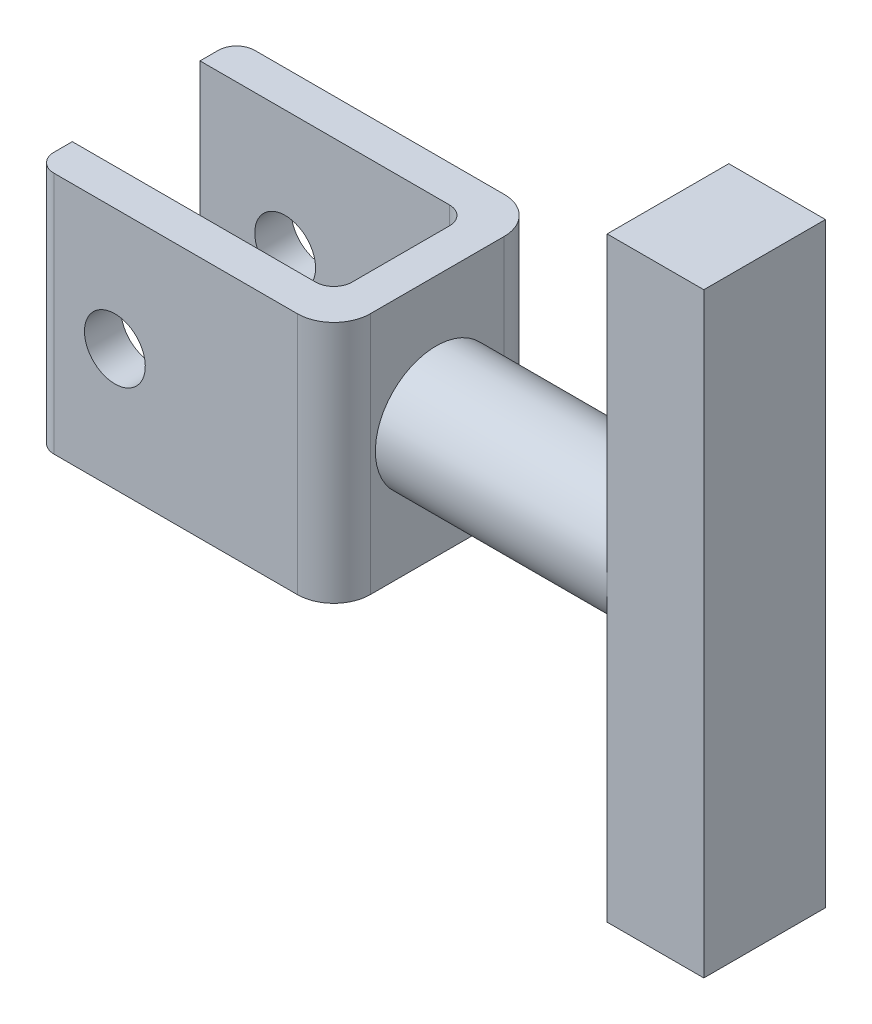
ISO-10303-21;
HEADER;
FILE_DESCRIPTION(('STEP AP214'),'2;1');
FILE_NAME('part.step','',(''),(''),'','','');
FILE_SCHEMA(('AUTOMOTIVE_DESIGN { 1 0 10303 214 1 1 1 1 }'));
ENDSEC;
DATA;
#1=APPLICATION_CONTEXT('core data for automotive mechanical design processes');
#2=APPLICATION_PROTOCOL_DEFINITION('international standard','automotive_design',2000,#1);
#3=PRODUCT_CONTEXT('',#1,'mechanical');
#4=PRODUCT('Part','Part','',(#3));
#5=PRODUCT_RELATED_PRODUCT_CATEGORY('part','',(#4));
#6=PRODUCT_DEFINITION_FORMATION('','',#4);
#7=PRODUCT_DEFINITION_CONTEXT('part definition',#1,'design');
#8=PRODUCT_DEFINITION('design','',#6,#7);
#9=PRODUCT_DEFINITION_SHAPE('','',#8);
#10=(LENGTH_UNIT() NAMED_UNIT(*) SI_UNIT(.MILLI.,.METRE.));
#11=(NAMED_UNIT(*) PLANE_ANGLE_UNIT() SI_UNIT($,.RADIAN.));
#12=(NAMED_UNIT(*) SI_UNIT($,.STERADIAN.) SOLID_ANGLE_UNIT());
#13=UNCERTAINTY_MEASURE_WITH_UNIT(LENGTH_MEASURE(1.E-05),#10,'distance_accuracy_value','');
#14=(GEOMETRIC_REPRESENTATION_CONTEXT(3) GLOBAL_UNCERTAINTY_ASSIGNED_CONTEXT((#13)) GLOBAL_UNIT_ASSIGNED_CONTEXT((#10,
#11,#12)) REPRESENTATION_CONTEXT('',''));
#15=CARTESIAN_POINT('',(0.,0.,0.));
#16=DIRECTION('',(0.,0.,1.));
#17=DIRECTION('',(1.,0.,0.));
#18=AXIS2_PLACEMENT_3D('',#15,#16,#17);
#19=CARTESIAN_POINT('',(39.3737373737374,0.,0.));
#20=DIRECTION('',(-1.,0.,0.));
#21=DIRECTION('',(0.,-1.,0.));
#22=AXIS2_PLACEMENT_3D('',#19,#20,#21);
#23=CYLINDRICAL_SURFACE('',#22,5.);
#24=CARTESIAN_POINT('',(12.3737373737374,0.,0.));
#25=DIRECTION('',(-1.,0.,0.));
#26=DIRECTION('',(0.,-1.,0.));
#27=AXIS2_PLACEMENT_3D('',#24,#25,#26);
#28=CIRCLE('',#27,5.);
#29=CARTESIAN_POINT('',(12.3737373737374,-5.,0.));
#30=VERTEX_POINT('',#29);
#31=EDGE_CURVE('E11',#30,#30,#28,.F.);
#32=ORIENTED_EDGE('',*,*,#31,.T.);
#33=EDGE_LOOP('',(#32));
#34=FACE_BOUND('',#33,.T.);
#35=CARTESIAN_POINT('',(31.4264677837374,0.,0.));
#36=DIRECTION('',(1.,0.,0.));
#37=DIRECTION('',(0.,1.,0.));
#38=AXIS2_PLACEMENT_3D('',#35,#36,#37);
#39=CIRCLE('',#38,5.);
#40=CARTESIAN_POINT('',(31.4264677837374,0.,5.));
#41=VERTEX_POINT('',#40);
#42=CARTESIAN_POINT('',(31.4264677837374,0.,-5.));
#43=VERTEX_POINT('',#42);
#44=EDGE_CURVE('E25',#41,#43,#39,.T.);
#45=ORIENTED_EDGE('',*,*,#44,.F.);
#46=CARTESIAN_POINT('',(31.4264677837374,0.,0.));
#47=DIRECTION('',(1.,0.,0.));
#48=DIRECTION('',(0.,1.,0.));
#49=AXIS2_PLACEMENT_3D('',#46,#47,#48);
#50=CIRCLE('',#49,5.);
#51=EDGE_CURVE('E40',#43,#41,#50,.T.);
#52=ORIENTED_EDGE('',*,*,#51,.F.);
#53=EDGE_LOOP('',(#45,#52));
#54=FACE_BOUND('',#53,.T.);
#55=ADVANCED_FACE('F17',(#34,#54),#23,.T.);
#56=CARTESIAN_POINT('',(12.3737373737374,-10.,-5.58585858585859));
#57=DIRECTION('',(-1.,0.,0.));
#58=DIRECTION('',(0.,-1.,0.));
#59=AXIS2_PLACEMENT_3D('',#56,#57,#58);
#60=PLANE('',#59);
#61=DIRECTION('',(0.,0.,1.));
#62=VECTOR('',#61,1.);
#63=CARTESIAN_POINT('',(12.3737373737374,10.,-5.58585858585859));
#64=LINE('',#63,#62);
#65=CARTESIAN_POINT('',(12.3737373737374,10.,-5.58585858585859));
#66=VERTEX_POINT('',#65);
#67=CARTESIAN_POINT('',(12.3737373737374,10.,5.41414141414142));
#68=VERTEX_POINT('',#67);
#69=EDGE_CURVE('E412',#66,#68,#64,.T.);
#70=ORIENTED_EDGE('',*,*,#69,.T.);
#71=DIRECTION('',(0.,1.,0.));
#72=VECTOR('',#71,1.);
#73=CARTESIAN_POINT('',(12.3737373737374,-10.,5.41414141414142));
#74=LINE('',#73,#72);
#75=CARTESIAN_POINT('',(12.3737373737374,-10.,5.41414141414142));
#76=VERTEX_POINT('',#75);
#77=EDGE_CURVE('E408',#76,#68,#74,.T.);
#78=ORIENTED_EDGE('',*,*,#77,.F.);
#79=DIRECTION('',(0.,0.,1.));
#80=VECTOR('',#79,1.);
#81=CARTESIAN_POINT('',(12.3737373737374,-10.,-5.58585858585859));
#82=LINE('',#81,#80);
#83=CARTESIAN_POINT('',(12.3737373737374,-10.,-5.58585858585859));
#84=VERTEX_POINT('',#83);
#85=EDGE_CURVE('E404',#84,#76,#82,.T.);
#86=ORIENTED_EDGE('',*,*,#85,.F.);
#87=DIRECTION('',(0.,1.,0.));
#88=VECTOR('',#87,1.);
#89=CARTESIAN_POINT('',(12.3737373737374,-10.,-5.58585858585859));
#90=LINE('',#89,#88);
#91=EDGE_CURVE('E401',#84,#66,#90,.T.);
#92=ORIENTED_EDGE('',*,*,#91,.T.);
#93=EDGE_LOOP('',(#70,#78,#86,#92));
#94=FACE_BOUND('',#93,.T.);
#95=ORIENTED_EDGE('',*,*,#31,.F.);
#96=EDGE_LOOP('',(#95));
#97=FACE_BOUND('',#96,.T.);
#98=ADVANCED_FACE('F439',(#94,#97),#60,.F.);
#99=CARTESIAN_POINT('',(-12.1262626262626,-10.,6.91414141414142));
#100=DIRECTION('',(1.,0.,0.));
#101=DIRECTION('',(0.,0.,1.));
#102=AXIS2_PLACEMENT_3D('',#99,#100,#101);
#103=PLANE('',#102);
#104=DIRECTION('',(0.,0.,-1.));
#105=VECTOR('',#104,1.);
#106=CARTESIAN_POINT('',(-12.1262626262626,10.,6.91414141414142));
#107=LINE('',#106,#105);
#108=CARTESIAN_POINT('',(-12.1262626262626,10.,6.91414141414142));
#109=VERTEX_POINT('',#108);
#110=CARTESIAN_POINT('',(-12.1262626262626,10.,5.41414141414142));
#111=VERTEX_POINT('',#110);
#112=EDGE_CURVE('E398',#109,#111,#107,.T.);
#113=ORIENTED_EDGE('',*,*,#112,.T.);
#114=DIRECTION('',(0.,1.,0.));
#115=VECTOR('',#114,1.);
#116=CARTESIAN_POINT('',(-12.1262626262626,-10.,5.41414141414142));
#117=LINE('',#116,#115);
#118=CARTESIAN_POINT('',(-12.1262626262626,-10.,5.41414141414142));
#119=VERTEX_POINT('',#118);
#120=EDGE_CURVE('E394',#119,#111,#117,.T.);
#121=ORIENTED_EDGE('',*,*,#120,.F.);
#122=DIRECTION('',(0.,0.,-1.));
#123=VECTOR('',#122,1.);
#124=CARTESIAN_POINT('',(-12.1262626262626,-10.,6.91414141414142));
#125=LINE('',#124,#123);
#126=CARTESIAN_POINT('',(-12.1262626262626,-10.,6.91414141414142));
#127=VERTEX_POINT('',#126);
#128=EDGE_CURVE('E390',#127,#119,#125,.T.);
#129=ORIENTED_EDGE('',*,*,#128,.F.);
#130=DIRECTION('',(0.,1.,0.));
#131=VECTOR('',#130,1.);
#132=CARTESIAN_POINT('',(-12.1262626262626,-10.,6.91414141414142));
#133=LINE('',#132,#131);
#134=EDGE_CURVE('E387',#127,#109,#133,.T.);
#135=ORIENTED_EDGE('',*,*,#134,.T.);
#136=EDGE_LOOP('',(#113,#121,#129,#135));
#137=FACE_BOUND('',#136,.T.);
#138=ADVANCED_FACE('F449',(#137),#103,.F.);
#139=CARTESIAN_POINT('',(-12.1262626262626,-10.,5.41414141414142));
#140=DIRECTION('',(0.,0.,1.));
#141=DIRECTION('',(0.,-1.,0.));
#142=AXIS2_PLACEMENT_3D('',#139,#140,#141);
#143=PLANE('',#142);
#144=CARTESIAN_POINT('',(-5.62626262626262,0.,5.41414141414141));
#145=DIRECTION('',(0.,0.,1.));
#146=DIRECTION('',(0.,-1.,0.));
#147=AXIS2_PLACEMENT_3D('',#144,#145,#146);
#148=CIRCLE('',#147,2.5);
#149=CARTESIAN_POINT('',(-5.62626262626262,-2.5,5.41414141414141));
#150=VERTEX_POINT('',#149);
#151=EDGE_CURVE('E383',#150,#150,#148,.T.);
#152=ORIENTED_EDGE('',*,*,#151,.T.);
#153=EDGE_LOOP('',(#152));
#154=FACE_BOUND('',#153,.T.);
#155=DIRECTION('',(1.,0.,0.));
#156=VECTOR('',#155,1.);
#157=CARTESIAN_POINT('',(-12.1262626262626,10.,5.41414141414142));
#158=LINE('',#157,#156);
#159=CARTESIAN_POINT('',(7.87373737373738,10.,5.41414141414142));
#160=VERTEX_POINT('',#159);
#161=EDGE_CURVE('E380',#111,#160,#158,.T.);
#162=ORIENTED_EDGE('',*,*,#161,.T.);
#163=DIRECTION('',(0.,1.,0.));
#164=VECTOR('',#163,1.);
#165=CARTESIAN_POINT('',(7.87373737373738,-10.,5.41414141414142));
#166=LINE('',#165,#164);
#167=CARTESIAN_POINT('',(7.87373737373738,-10.,5.41414141414142));
#168=VERTEX_POINT('',#167);
#169=EDGE_CURVE('E376',#168,#160,#166,.T.);
#170=ORIENTED_EDGE('',*,*,#169,.F.);
#171=DIRECTION('',(1.,0.,0.));
#172=VECTOR('',#171,1.);
#173=CARTESIAN_POINT('',(-12.1262626262626,-10.,5.41414141414142));
#174=LINE('',#173,#172);
#175=EDGE_CURVE('E372',#119,#168,#174,.T.);
#176=ORIENTED_EDGE('',*,*,#175,.F.);
#177=ORIENTED_EDGE('',*,*,#120,.T.);
#178=EDGE_LOOP('',(#162,#170,#176,#177));
#179=FACE_BOUND('',#178,.T.);
#180=ADVANCED_FACE('F458',(#154,#179),#143,.F.);
#181=CARTESIAN_POINT('',(7.87373737373737,-10.,3.91414141414142));
#182=DIRECTION('',(0.,1.,0.));
#183=DIRECTION('',(-1.,0.,0.));
#184=AXIS2_PLACEMENT_3D('',#181,#182,#183);
#185=CYLINDRICAL_SURFACE('',#184,1.5);
#186=CARTESIAN_POINT('',(7.87373737373737,10.,3.91414141414142));
#187=DIRECTION('',(0.,1.,0.));
#188=DIRECTION('',(-1.,0.,0.));
#189=AXIS2_PLACEMENT_3D('',#186,#187,#188);
#190=CIRCLE('',#189,1.5);
#191=CARTESIAN_POINT('',(9.37373737373737,10.,3.91414141414142));
#192=VERTEX_POINT('',#191);
#193=EDGE_CURVE('E369',#160,#192,#190,.T.);
#194=ORIENTED_EDGE('',*,*,#193,.T.);
#195=DIRECTION('',(0.,1.,0.));
#196=VECTOR('',#195,1.);
#197=CARTESIAN_POINT('',(9.37373737373737,-10.,3.91414141414142));
#198=LINE('',#197,#196);
#199=CARTESIAN_POINT('',(9.37373737373737,-10.,3.91414141414142));
#200=VERTEX_POINT('',#199);
#201=EDGE_CURVE('E365',#200,#192,#198,.T.);
#202=ORIENTED_EDGE('',*,*,#201,.F.);
#203=CARTESIAN_POINT('',(7.87373737373737,-10.,3.91414141414142));
#204=DIRECTION('',(0.,1.,0.));
#205=DIRECTION('',(-1.,0.,0.));
#206=AXIS2_PLACEMENT_3D('',#203,#204,#205);
#207=CIRCLE('',#206,1.5);
#208=EDGE_CURVE('E361',#168,#200,#207,.T.);
#209=ORIENTED_EDGE('',*,*,#208,.F.);
#210=ORIENTED_EDGE('',*,*,#169,.T.);
#211=EDGE_LOOP('',(#194,#202,#209,#210));
#212=FACE_BOUND('',#211,.T.);
#213=ADVANCED_FACE('F468',(#212),#185,.F.);
#214=CARTESIAN_POINT('',(9.37373737373737,-10.,-4.08585858585859));
#215=DIRECTION('',(1.,0.,0.));
#216=DIRECTION('',(0.,1.,0.));
#217=AXIS2_PLACEMENT_3D('',#214,#215,#216);
#218=PLANE('',#217);
#219=DIRECTION('',(0.,0.,-1.));
#220=VECTOR('',#219,1.);
#221=CARTESIAN_POINT('',(9.37373737373737,10.,-4.08585858585859));
#222=LINE('',#221,#220);
#223=CARTESIAN_POINT('',(9.37373737373737,10.,-4.08585858585859));
#224=VERTEX_POINT('',#223);
#225=EDGE_CURVE('E358',#192,#224,#222,.T.);
#226=ORIENTED_EDGE('',*,*,#225,.T.);
#227=DIRECTION('',(0.,1.,0.));
#228=VECTOR('',#227,1.);
#229=CARTESIAN_POINT('',(9.37373737373737,-10.,-4.08585858585859));
#230=LINE('',#229,#228);
#231=CARTESIAN_POINT('',(9.37373737373737,-10.,-4.08585858585859));
#232=VERTEX_POINT('',#231);
#233=EDGE_CURVE('E354',#232,#224,#230,.T.);
#234=ORIENTED_EDGE('',*,*,#233,.F.);
#235=DIRECTION('',(0.,0.,-1.));
#236=VECTOR('',#235,1.);
#237=CARTESIAN_POINT('',(9.37373737373737,-10.,-4.08585858585859));
#238=LINE('',#237,#236);
#239=EDGE_CURVE('E350',#200,#232,#238,.T.);
#240=ORIENTED_EDGE('',*,*,#239,.F.);
#241=ORIENTED_EDGE('',*,*,#201,.T.);
#242=EDGE_LOOP('',(#226,#234,#240,#241));
#243=FACE_BOUND('',#242,.T.);
#244=ADVANCED_FACE('F478',(#243),#218,.F.);
#245=CARTESIAN_POINT('',(7.87373737373737,-10.,-4.08585858585859));
#246=DIRECTION('',(0.,1.,0.));
#247=DIRECTION('',(-1.,0.,0.));
#248=AXIS2_PLACEMENT_3D('',#245,#246,#247);
#249=CYLINDRICAL_SURFACE('',#248,1.5);
#250=CARTESIAN_POINT('',(7.87373737373737,10.,-4.08585858585859));
#251=DIRECTION('',(0.,1.,0.));
#252=DIRECTION('',(-1.,0.,0.));
#253=AXIS2_PLACEMENT_3D('',#250,#251,#252);
#254=CIRCLE('',#253,1.5);
#255=CARTESIAN_POINT('',(7.87373737373737,10.,-5.58585858585858));
#256=VERTEX_POINT('',#255);
#257=EDGE_CURVE('E347',#224,#256,#254,.T.);
#258=ORIENTED_EDGE('',*,*,#257,.T.);
#259=DIRECTION('',(0.,1.,0.));
#260=VECTOR('',#259,1.);
#261=CARTESIAN_POINT('',(7.87373737373737,-10.,-5.58585858585858));
#262=LINE('',#261,#260);
#263=CARTESIAN_POINT('',(7.87373737373737,-10.,-5.58585858585858));
#264=VERTEX_POINT('',#263);
#265=EDGE_CURVE('E343',#264,#256,#262,.T.);
#266=ORIENTED_EDGE('',*,*,#265,.F.);
#267=CARTESIAN_POINT('',(7.87373737373737,-10.,-4.08585858585859));
#268=DIRECTION('',(0.,1.,0.));
#269=DIRECTION('',(-1.,0.,0.));
#270=AXIS2_PLACEMENT_3D('',#267,#268,#269);
#271=CIRCLE('',#270,1.5);
#272=EDGE_CURVE('E339',#232,#264,#271,.T.);
#273=ORIENTED_EDGE('',*,*,#272,.F.);
#274=ORIENTED_EDGE('',*,*,#233,.T.);
#275=EDGE_LOOP('',(#258,#266,#273,#274));
#276=FACE_BOUND('',#275,.T.);
#277=ADVANCED_FACE('F488',(#276),#249,.F.);
#278=CARTESIAN_POINT('',(-12.6262626262626,-10.,-5.58585858585859));
#279=DIRECTION('',(0.,0.,-1.));
#280=DIRECTION('',(0.,1.,0.));
#281=AXIS2_PLACEMENT_3D('',#278,#279,#280);
#282=PLANE('',#281);
#283=CARTESIAN_POINT('',(-5.62626262626262,0.,-5.58585858585858));
#284=DIRECTION('',(0.,0.,-1.));
#285=DIRECTION('',(0.,1.,0.));
#286=AXIS2_PLACEMENT_3D('',#283,#284,#285);
#287=CIRCLE('',#286,2.5);
#288=CARTESIAN_POINT('',(-5.62626262626262,2.5,-5.58585858585858));
#289=VERTEX_POINT('',#288);
#290=EDGE_CURVE('E335',#289,#289,#287,.T.);
#291=ORIENTED_EDGE('',*,*,#290,.T.);
#292=EDGE_LOOP('',(#291));
#293=FACE_BOUND('',#292,.T.);
#294=DIRECTION('',(-1.,0.,0.));
#295=VECTOR('',#294,1.);
#296=CARTESIAN_POINT('',(-12.6262626262626,10.,-5.58585858585859));
#297=LINE('',#296,#295);
#298=CARTESIAN_POINT('',(-12.6262626262626,10.,-5.58585858585859));
#299=VERTEX_POINT('',#298);
#300=EDGE_CURVE('E332',#256,#299,#297,.T.);
#301=ORIENTED_EDGE('',*,*,#300,.T.);
#302=DIRECTION('',(0.,1.,0.));
#303=VECTOR('',#302,1.);
#304=CARTESIAN_POINT('',(-12.6262626262626,-10.,-5.58585858585859));
#305=LINE('',#304,#303);
#306=CARTESIAN_POINT('',(-12.6262626262626,-10.,-5.58585858585859));
#307=VERTEX_POINT('',#306);
#308=EDGE_CURVE('E328',#307,#299,#305,.T.);
#309=ORIENTED_EDGE('',*,*,#308,.F.);
#310=DIRECTION('',(-1.,0.,0.));
#311=VECTOR('',#310,1.);
#312=CARTESIAN_POINT('',(-12.6262626262626,-10.,-5.58585858585859));
#313=LINE('',#312,#311);
#314=EDGE_CURVE('E324',#264,#307,#313,.T.);
#315=ORIENTED_EDGE('',*,*,#314,.F.);
#316=ORIENTED_EDGE('',*,*,#265,.T.);
#317=EDGE_LOOP('',(#301,#309,#315,#316));
#318=FACE_BOUND('',#317,.T.);
#319=ADVANCED_FACE('F498',(#293,#318),#282,.F.);
#320=CARTESIAN_POINT('',(-12.6262626262626,-10.,-5.58585858585859));
#321=DIRECTION('',(1.,0.,0.));
#322=DIRECTION('',(0.,0.,1.));
#323=AXIS2_PLACEMENT_3D('',#320,#321,#322);
#324=PLANE('',#323);
#325=DIRECTION('',(0.,0.,-1.));
#326=VECTOR('',#325,1.);
#327=CARTESIAN_POINT('',(-12.6262626262626,10.,-5.58585858585859));
#328=LINE('',#327,#326);
#329=CARTESIAN_POINT('',(-12.6262626262626,10.,-7.08585858585859));
#330=VERTEX_POINT('',#329);
#331=EDGE_CURVE('E321',#299,#330,#328,.T.);
#332=ORIENTED_EDGE('',*,*,#331,.T.);
#333=DIRECTION('',(0.,1.,0.));
#334=VECTOR('',#333,1.);
#335=CARTESIAN_POINT('',(-12.6262626262626,-10.,-7.08585858585859));
#336=LINE('',#335,#334);
#337=CARTESIAN_POINT('',(-12.6262626262626,-10.,-7.08585858585859));
#338=VERTEX_POINT('',#337);
#339=EDGE_CURVE('E317',#338,#330,#336,.T.);
#340=ORIENTED_EDGE('',*,*,#339,.F.);
#341=DIRECTION('',(0.,0.,-1.));
#342=VECTOR('',#341,1.);
#343=CARTESIAN_POINT('',(-12.6262626262626,-10.,-5.58585858585859));
#344=LINE('',#343,#342);
#345=EDGE_CURVE('E313',#307,#338,#344,.T.);
#346=ORIENTED_EDGE('',*,*,#345,.F.);
#347=ORIENTED_EDGE('',*,*,#308,.T.);
#348=EDGE_LOOP('',(#332,#340,#346,#347));
#349=FACE_BOUND('',#348,.T.);
#350=ADVANCED_FACE('F508',(#349),#324,.F.);
#351=CARTESIAN_POINT('',(-11.1262626262626,-10.,-7.08585858585859));
#352=DIRECTION('',(0.,1.,0.));
#353=DIRECTION('',(-1.,0.,0.));
#354=AXIS2_PLACEMENT_3D('',#351,#352,#353);
#355=CYLINDRICAL_SURFACE('',#354,1.5);
#356=CARTESIAN_POINT('',(-11.1262626262626,10.,-7.08585858585859));
#357=DIRECTION('',(0.,-1.,0.));
#358=DIRECTION('',(-1.,0.,0.));
#359=AXIS2_PLACEMENT_3D('',#356,#357,#358);
#360=CIRCLE('',#359,1.5);
#361=CARTESIAN_POINT('',(-11.1262626262626,10.,-8.58585858585858));
#362=VERTEX_POINT('',#361);
#363=EDGE_CURVE('E310',#330,#362,#360,.T.);
#364=ORIENTED_EDGE('',*,*,#363,.T.);
#365=DIRECTION('',(0.,1.,0.));
#366=VECTOR('',#365,1.);
#367=CARTESIAN_POINT('',(-11.1262626262626,-10.,-8.58585858585858));
#368=LINE('',#367,#366);
#369=CARTESIAN_POINT('',(-11.1262626262626,-10.,-8.58585858585858));
#370=VERTEX_POINT('',#369);
#371=EDGE_CURVE('E306',#370,#362,#368,.T.);
#372=ORIENTED_EDGE('',*,*,#371,.F.);
#373=CARTESIAN_POINT('',(-11.1262626262626,-10.,-7.08585858585859));
#374=DIRECTION('',(0.,-1.,0.));
#375=DIRECTION('',(-1.,0.,0.));
#376=AXIS2_PLACEMENT_3D('',#373,#374,#375);
#377=CIRCLE('',#376,1.5);
#378=EDGE_CURVE('E302',#338,#370,#377,.T.);
#379=ORIENTED_EDGE('',*,*,#378,.F.);
#380=ORIENTED_EDGE('',*,*,#339,.T.);
#381=EDGE_LOOP('',(#364,#372,#379,#380));
#382=FACE_BOUND('',#381,.T.);
#383=ADVANCED_FACE('F518',(#382),#355,.T.);
#384=CARTESIAN_POINT('',(-11.1262626262626,-10.,-8.58585858585858));
#385=DIRECTION('',(0.,0.,1.));
#386=DIRECTION('',(0.,-1.,0.));
#387=AXIS2_PLACEMENT_3D('',#384,#385,#386);
#388=PLANE('',#387);
#389=CARTESIAN_POINT('',(-5.62626262626262,0.,-8.58585858585858));
#390=DIRECTION('',(0.,0.,1.));
#391=DIRECTION('',(0.,-1.,0.));
#392=AXIS2_PLACEMENT_3D('',#389,#390,#391);
#393=CIRCLE('',#392,2.5);
#394=CARTESIAN_POINT('',(-5.62626262626262,-2.5,-8.58585858585858));
#395=VERTEX_POINT('',#394);
#396=EDGE_CURVE('E298',#395,#395,#393,.T.);
#397=ORIENTED_EDGE('',*,*,#396,.T.);
#398=EDGE_LOOP('',(#397));
#399=FACE_BOUND('',#398,.T.);
#400=DIRECTION('',(1.,0.,0.));
#401=VECTOR('',#400,1.);
#402=CARTESIAN_POINT('',(-11.1262626262626,10.,-8.58585858585858));
#403=LINE('',#402,#401);
#404=CARTESIAN_POINT('',(9.37373737373738,10.,-8.58585858585858));
#405=VERTEX_POINT('',#404);
#406=EDGE_CURVE('E295',#362,#405,#403,.T.);
#407=ORIENTED_EDGE('',*,*,#406,.T.);
#408=DIRECTION('',(0.,1.,0.));
#409=VECTOR('',#408,1.);
#410=CARTESIAN_POINT('',(9.37373737373738,-10.,-8.58585858585858));
#411=LINE('',#410,#409);
#412=CARTESIAN_POINT('',(9.37373737373738,-10.,-8.58585858585858));
#413=VERTEX_POINT('',#412);
#414=EDGE_CURVE('E291',#413,#405,#411,.T.);
#415=ORIENTED_EDGE('',*,*,#414,.F.);
#416=DIRECTION('',(1.,0.,0.));
#417=VECTOR('',#416,1.);
#418=CARTESIAN_POINT('',(-11.1262626262626,-10.,-8.58585858585858));
#419=LINE('',#418,#417);
#420=EDGE_CURVE('E287',#370,#413,#419,.T.);
#421=ORIENTED_EDGE('',*,*,#420,.F.);
#422=ORIENTED_EDGE('',*,*,#371,.T.);
#423=EDGE_LOOP('',(#407,#415,#421,#422));
#424=FACE_BOUND('',#423,.T.);
#425=ADVANCED_FACE('F528',(#399,#424),#388,.F.);
#426=CARTESIAN_POINT('',(9.37373737373738,-10.,-5.58585858585859));
#427=DIRECTION('',(0.,1.,0.));
#428=DIRECTION('',(-1.,0.,0.));
#429=AXIS2_PLACEMENT_3D('',#426,#427,#428);
#430=CYLINDRICAL_SURFACE('',#429,3.);
#431=CARTESIAN_POINT('',(9.37373737373738,10.,-5.58585858585859));
#432=DIRECTION('',(0.,-1.,0.));
#433=DIRECTION('',(1.,0.,0.));
#434=AXIS2_PLACEMENT_3D('',#431,#432,#433);
#435=CIRCLE('',#434,3.);
#436=EDGE_CURVE('E283',#405,#66,#435,.T.);
#437=ORIENTED_EDGE('',*,*,#436,.T.);
#438=ORIENTED_EDGE('',*,*,#91,.F.);
#439=CARTESIAN_POINT('',(9.37373737373738,-10.,-5.58585858585859));
#440=DIRECTION('',(0.,-1.,0.));
#441=DIRECTION('',(1.,0.,0.));
#442=AXIS2_PLACEMENT_3D('',#439,#440,#441);
#443=CIRCLE('',#442,3.);
#444=EDGE_CURVE('E279',#413,#84,#443,.T.);
#445=ORIENTED_EDGE('',*,*,#444,.F.);
#446=ORIENTED_EDGE('',*,*,#414,.T.);
#447=EDGE_LOOP('',(#437,#438,#445,#446));
#448=FACE_BOUND('',#447,.T.);
#449=ADVANCED_FACE('F538',(#448),#430,.T.);
#450=CARTESIAN_POINT('',(9.37373737373738,-10.,5.41414141414142));
#451=DIRECTION('',(0.,1.,0.));
#452=DIRECTION('',(-1.,0.,0.));
#453=AXIS2_PLACEMENT_3D('',#450,#451,#452);
#454=CYLINDRICAL_SURFACE('',#453,3.);
#455=CARTESIAN_POINT('',(9.37373737373738,10.,5.41414141414142));
#456=DIRECTION('',(0.,-1.,0.));
#457=DIRECTION('',(-1.,0.,0.));
#458=AXIS2_PLACEMENT_3D('',#455,#456,#457);
#459=CIRCLE('',#458,3.);
#460=CARTESIAN_POINT('',(9.37373737373738,10.,8.41414141414142));
#461=VERTEX_POINT('',#460);
#462=EDGE_CURVE('E276',#68,#461,#459,.T.);
#463=ORIENTED_EDGE('',*,*,#462,.T.);
#464=DIRECTION('',(0.,1.,0.));
#465=VECTOR('',#464,1.);
#466=CARTESIAN_POINT('',(9.37373737373738,-10.,8.41414141414142));
#467=LINE('',#466,#465);
#468=CARTESIAN_POINT('',(9.37373737373738,-10.,8.41414141414142));
#469=VERTEX_POINT('',#468);
#470=EDGE_CURVE('E272',#469,#461,#467,.T.);
#471=ORIENTED_EDGE('',*,*,#470,.F.);
#472=CARTESIAN_POINT('',(9.37373737373738,-10.,5.41414141414142));
#473=DIRECTION('',(0.,-1.,0.));
#474=DIRECTION('',(-1.,0.,0.));
#475=AXIS2_PLACEMENT_3D('',#472,#473,#474);
#476=CIRCLE('',#475,3.);
#477=EDGE_CURVE('E268',#76,#469,#476,.T.);
#478=ORIENTED_EDGE('',*,*,#477,.F.);
#479=ORIENTED_EDGE('',*,*,#77,.T.);
#480=EDGE_LOOP('',(#463,#471,#478,#479));
#481=FACE_BOUND('',#480,.T.);
#482=ADVANCED_FACE('F548',(#481),#454,.T.);
#483=CARTESIAN_POINT('',(-10.6262626262626,-10.,8.41414141414142));
#484=DIRECTION('',(0.,0.,-1.));
#485=DIRECTION('',(0.,1.,0.));
#486=AXIS2_PLACEMENT_3D('',#483,#484,#485);
#487=PLANE('',#486);
#488=CARTESIAN_POINT('',(-5.62626262626262,0.,8.41414141414142));
#489=DIRECTION('',(0.,0.,1.));
#490=DIRECTION('',(0.,-1.,0.));
#491=AXIS2_PLACEMENT_3D('',#488,#489,#490);
#492=CIRCLE('',#491,2.5);
#493=CARTESIAN_POINT('',(-5.62626262626262,-2.5,8.41414141414142));
#494=VERTEX_POINT('',#493);
#495=EDGE_CURVE('E264',#494,#494,#492,.T.);
#496=ORIENTED_EDGE('',*,*,#495,.F.);
#497=EDGE_LOOP('',(#496));
#498=FACE_BOUND('',#497,.T.);
#499=DIRECTION('',(-1.,0.,0.));
#500=VECTOR('',#499,1.);
#501=CARTESIAN_POINT('',(-10.6262626262626,10.,8.41414141414142));
#502=LINE('',#501,#500);
#503=CARTESIAN_POINT('',(-10.6262626262626,10.,8.41414141414142));
#504=VERTEX_POINT('',#503);
#505=EDGE_CURVE('E261',#461,#504,#502,.T.);
#506=ORIENTED_EDGE('',*,*,#505,.T.);
#507=DIRECTION('',(0.,1.,0.));
#508=VECTOR('',#507,1.);
#509=CARTESIAN_POINT('',(-10.6262626262626,-10.,8.41414141414142));
#510=LINE('',#509,#508);
#511=CARTESIAN_POINT('',(-10.6262626262626,-10.,8.41414141414142));
#512=VERTEX_POINT('',#511);
#513=EDGE_CURVE('E257',#512,#504,#510,.T.);
#514=ORIENTED_EDGE('',*,*,#513,.F.);
#515=DIRECTION('',(-1.,0.,0.));
#516=VECTOR('',#515,1.);
#517=CARTESIAN_POINT('',(-10.6262626262626,-10.,8.41414141414142));
#518=LINE('',#517,#516);
#519=EDGE_CURVE('E253',#469,#512,#518,.T.);
#520=ORIENTED_EDGE('',*,*,#519,.F.);
#521=ORIENTED_EDGE('',*,*,#470,.T.);
#522=EDGE_LOOP('',(#506,#514,#520,#521));
#523=FACE_BOUND('',#522,.T.);
#524=ADVANCED_FACE('F558',(#498,#523),#487,.F.);
#525=CARTESIAN_POINT('',(-10.6262626262626,-10.,6.91414141414142));
#526=DIRECTION('',(0.,1.,0.));
#527=DIRECTION('',(-1.,0.,0.));
#528=AXIS2_PLACEMENT_3D('',#525,#526,#527);
#529=CYLINDRICAL_SURFACE('',#528,1.5);
#530=CARTESIAN_POINT('',(-10.6262626262626,10.,6.91414141414142));
#531=DIRECTION('',(0.,-1.,0.));
#532=DIRECTION('',(-1.,0.,0.));
#533=AXIS2_PLACEMENT_3D('',#530,#531,#532);
#534=CIRCLE('',#533,1.5);
#535=EDGE_CURVE('E249',#504,#109,#534,.T.);
#536=ORIENTED_EDGE('',*,*,#535,.T.);
#537=ORIENTED_EDGE('',*,*,#134,.F.);
#538=CARTESIAN_POINT('',(-10.6262626262626,-10.,6.91414141414142));
#539=DIRECTION('',(0.,-1.,0.));
#540=DIRECTION('',(-1.,0.,0.));
#541=AXIS2_PLACEMENT_3D('',#538,#539,#540);
#542=CIRCLE('',#541,1.5);
#543=EDGE_CURVE('E245',#512,#127,#542,.T.);
#544=ORIENTED_EDGE('',*,*,#543,.F.);
#545=ORIENTED_EDGE('',*,*,#513,.T.);
#546=EDGE_LOOP('',(#536,#537,#544,#545));
#547=FACE_BOUND('',#546,.T.);
#548=ADVANCED_FACE('F568',(#547),#529,.T.);
#549=CARTESIAN_POINT('',(7.87373737373737,-10.,3.91414141414142));
#550=DIRECTION('',(0.,1.,0.));
#551=DIRECTION('',(-1.,0.,0.));
#552=AXIS2_PLACEMENT_3D('',#549,#550,#551);
#553=PLANE('',#552);
#554=ORIENTED_EDGE('',*,*,#128,.T.);
#555=ORIENTED_EDGE('',*,*,#175,.T.);
#556=ORIENTED_EDGE('',*,*,#208,.T.);
#557=ORIENTED_EDGE('',*,*,#239,.T.);
#558=ORIENTED_EDGE('',*,*,#272,.T.);
#559=ORIENTED_EDGE('',*,*,#314,.T.);
#560=ORIENTED_EDGE('',*,*,#345,.T.);
#561=ORIENTED_EDGE('',*,*,#378,.T.);
#562=ORIENTED_EDGE('',*,*,#420,.T.);
#563=ORIENTED_EDGE('',*,*,#444,.T.);
#564=ORIENTED_EDGE('',*,*,#85,.T.);
#565=ORIENTED_EDGE('',*,*,#477,.T.);
#566=ORIENTED_EDGE('',*,*,#519,.T.);
#567=ORIENTED_EDGE('',*,*,#543,.T.);
#568=EDGE_LOOP('',(#554,#555,#556,#557,#558,#559,#560,#561,#562,#563,#564,#565,#566,#567));
#569=FACE_BOUND('',#568,.T.);
#570=ADVANCED_FACE('F578',(#569),#553,.F.);
#571=CARTESIAN_POINT('',(7.87373737373737,10.,3.91414141414142));
#572=DIRECTION('',(0.,1.,0.));
#573=DIRECTION('',(-1.,0.,0.));
#574=AXIS2_PLACEMENT_3D('',#571,#572,#573);
#575=PLANE('',#574);
#576=ORIENTED_EDGE('',*,*,#112,.F.);
#577=ORIENTED_EDGE('',*,*,#535,.F.);
#578=ORIENTED_EDGE('',*,*,#505,.F.);
#579=ORIENTED_EDGE('',*,*,#462,.F.);
#580=ORIENTED_EDGE('',*,*,#69,.F.);
#581=ORIENTED_EDGE('',*,*,#436,.F.);
#582=ORIENTED_EDGE('',*,*,#406,.F.);
#583=ORIENTED_EDGE('',*,*,#363,.F.);
#584=ORIENTED_EDGE('',*,*,#331,.F.);
#585=ORIENTED_EDGE('',*,*,#300,.F.);
#586=ORIENTED_EDGE('',*,*,#257,.F.);
#587=ORIENTED_EDGE('',*,*,#225,.F.);
#588=ORIENTED_EDGE('',*,*,#193,.F.);
#589=ORIENTED_EDGE('',*,*,#161,.F.);
#590=EDGE_LOOP('',(#576,#577,#578,#579,#580,#581,#582,#583,#584,#585,#586,#587,#588,#589));
#591=FACE_BOUND('',#590,.T.);
#592=ADVANCED_FACE('F588',(#591),#575,.T.);
#593=CARTESIAN_POINT('',(-5.62626262626262,0.,-91.5858585858586));
#594=DIRECTION('',(0.,0.,1.));
#595=DIRECTION('',(0.,-1.,0.));
#596=AXIS2_PLACEMENT_3D('',#593,#594,#595);
#597=CYLINDRICAL_SURFACE('',#596,2.5);
#598=ORIENTED_EDGE('',*,*,#495,.T.);
#599=EDGE_LOOP('',(#598));
#600=FACE_BOUND('',#599,.T.);
#601=ORIENTED_EDGE('',*,*,#151,.F.);
#602=EDGE_LOOP('',(#601));
#603=FACE_BOUND('',#602,.T.);
#604=ADVANCED_FACE('F598',(#600,#603),#597,.F.);
#605=CARTESIAN_POINT('',(-5.62626262626262,0.,-91.5858585858586));
#606=DIRECTION('',(0.,0.,1.));
#607=DIRECTION('',(0.,-1.,0.));
#608=AXIS2_PLACEMENT_3D('',#605,#606,#607);
#609=CYLINDRICAL_SURFACE('',#608,2.5);
#610=ORIENTED_EDGE('',*,*,#396,.F.);
#611=EDGE_LOOP('',(#610));
#612=FACE_BOUND('',#611,.T.);
#613=ORIENTED_EDGE('',*,*,#290,.F.);
#614=EDGE_LOOP('',(#613));
#615=FACE_BOUND('',#614,.T.);
#616=ADVANCED_FACE('F608',(#612,#615),#609,.F.);
#617=CARTESIAN_POINT('',(31.4264677837374,25.,5.));
#618=DIRECTION('',(1.,0.,0.));
#619=DIRECTION('',(0.,1.,0.));
#620=AXIS2_PLACEMENT_3D('',#617,#618,#619);
#621=PLANE('',#620);
#622=DIRECTION('',(0.,-1.,0.));
#623=VECTOR('',#622,1.);
#624=CARTESIAN_POINT('',(31.4264677837374,25.,5.));
#625=LINE('',#624,#623);
#626=CARTESIAN_POINT('',(31.4264677837374,-24.,5.));
#627=VERTEX_POINT('',#626);
#628=EDGE_CURVE('E241',#41,#627,#625,.T.);
#629=ORIENTED_EDGE('',*,*,#628,.F.);
#630=ORIENTED_EDGE('',*,*,#44,.T.);
#631=DIRECTION('',(0.,-1.,0.));
#632=VECTOR('',#631,1.);
#633=CARTESIAN_POINT('',(31.4264677837374,25.,-5.));
#634=LINE('',#633,#632);
#635=CARTESIAN_POINT('',(31.4264677837374,-24.,-5.));
#636=VERTEX_POINT('',#635);
#637=EDGE_CURVE('E238',#43,#636,#634,.T.);
#638=ORIENTED_EDGE('',*,*,#637,.T.);
#639=DIRECTION('',(0.,0.,1.));
#640=VECTOR('',#639,1.);
#641=CARTESIAN_POINT('',(31.4264677837374,-24.,5.));
#642=LINE('',#641,#640);
#643=EDGE_CURVE('E235',#636,#627,#642,.T.);
#644=ORIENTED_EDGE('',*,*,#643,.T.);
#645=EDGE_LOOP('',(#629,#630,#638,#644));
#646=FACE_BOUND('',#645,.T.);
#647=ADVANCED_FACE('F419',(#646),#621,.F.);
#648=CARTESIAN_POINT('',(39.3737373737374,25.,5.));
#649=DIRECTION('',(0.,0.,-1.));
#650=DIRECTION('',(1.,0.,0.));
#651=AXIS2_PLACEMENT_3D('',#648,#649,#650);
#652=PLANE('',#651);
#653=DIRECTION('',(1.,0.,0.));
#654=VECTOR('',#653,1.);
#655=CARTESIAN_POINT('',(39.3737373737374,-24.,5.));
#656=LINE('',#655,#654);
#657=CARTESIAN_POINT('',(39.3737373737374,-24.,5.));
#658=VERTEX_POINT('',#657);
#659=EDGE_CURVE('E232',#627,#658,#656,.T.);
#660=ORIENTED_EDGE('',*,*,#659,.T.);
#661=DIRECTION('',(0.,-1.,0.));
#662=VECTOR('',#661,1.);
#663=CARTESIAN_POINT('',(39.3737373737374,25.,5.));
#664=LINE('',#663,#662);
#665=CARTESIAN_POINT('',(39.3737373737374,25.,5.));
#666=VERTEX_POINT('',#665);
#667=EDGE_CURVE('E229',#666,#658,#664,.T.);
#668=ORIENTED_EDGE('',*,*,#667,.F.);
#669=DIRECTION('',(1.,0.,0.));
#670=VECTOR('',#669,1.);
#671=CARTESIAN_POINT('',(39.3737373737374,25.,5.));
#672=LINE('',#671,#670);
#673=CARTESIAN_POINT('',(31.4264677837374,25.,5.));
#674=VERTEX_POINT('',#673);
#675=EDGE_CURVE('E206',#674,#666,#672,.T.);
#676=ORIENTED_EDGE('',*,*,#675,.F.);
#677=DIRECTION('',(0.,-1.,0.));
#678=VECTOR('',#677,1.);
#679=CARTESIAN_POINT('',(31.4264677837374,25.,5.));
#680=LINE('',#679,#678);
#681=EDGE_CURVE('E216',#674,#41,#680,.T.);
#682=ORIENTED_EDGE('',*,*,#681,.T.);
#683=ORIENTED_EDGE('',*,*,#628,.T.);
#684=EDGE_LOOP('',(#660,#668,#676,#682,#683));
#685=FACE_BOUND('',#684,.T.);
#686=ADVANCED_FACE('F627',(#685),#652,.F.);
#687=CARTESIAN_POINT('',(39.3737373737374,25.,-5.));
#688=DIRECTION('',(0.,0.,1.));
#689=DIRECTION('',(0.,-1.,0.));
#690=AXIS2_PLACEMENT_3D('',#687,#688,#689);
#691=PLANE('',#690);
#692=DIRECTION('',(0.,-1.,0.));
#693=VECTOR('',#692,1.);
#694=CARTESIAN_POINT('',(39.3737373737374,25.,-5.));
#695=LINE('',#694,#693);
#696=CARTESIAN_POINT('',(39.3737373737374,25.,-5.));
#697=VERTEX_POINT('',#696);
#698=CARTESIAN_POINT('',(39.3737373737374,-24.,-5.));
#699=VERTEX_POINT('',#698);
#700=EDGE_CURVE('E191',#697,#699,#695,.T.);
#701=ORIENTED_EDGE('',*,*,#700,.T.);
#702=DIRECTION('',(-1.,0.,0.));
#703=VECTOR('',#702,1.);
#704=CARTESIAN_POINT('',(39.3737373737374,-24.,-5.));
#705=LINE('',#704,#703);
#706=EDGE_CURVE('E217',#699,#636,#705,.T.);
#707=ORIENTED_EDGE('',*,*,#706,.T.);
#708=ORIENTED_EDGE('',*,*,#637,.F.);
#709=DIRECTION('',(0.,-1.,0.));
#710=VECTOR('',#709,1.);
#711=CARTESIAN_POINT('',(31.4264677837374,25.,-5.));
#712=LINE('',#711,#710);
#713=CARTESIAN_POINT('',(31.4264677837374,25.,-5.));
#714=VERTEX_POINT('',#713);
#715=EDGE_CURVE('E195',#714,#43,#712,.T.);
#716=ORIENTED_EDGE('',*,*,#715,.F.);
#717=DIRECTION('',(-1.,0.,0.));
#718=VECTOR('',#717,1.);
#719=CARTESIAN_POINT('',(39.3737373737374,25.,-5.));
#720=LINE('',#719,#718);
#721=EDGE_CURVE('E186',#697,#714,#720,.T.);
#722=ORIENTED_EDGE('',*,*,#721,.F.);
#723=EDGE_LOOP('',(#701,#707,#708,#716,#722));
#724=FACE_BOUND('',#723,.T.);
#725=ADVANCED_FACE('F188',(#724),#691,.F.);
#726=CARTESIAN_POINT('',(31.4264677837374,25.,5.));
#727=DIRECTION('',(1.,0.,0.));
#728=DIRECTION('',(0.,1.,0.));
#729=AXIS2_PLACEMENT_3D('',#726,#727,#728);
#730=PLANE('',#729);
#731=ORIENTED_EDGE('',*,*,#715,.T.);
#732=ORIENTED_EDGE('',*,*,#51,.T.);
#733=ORIENTED_EDGE('',*,*,#681,.F.);
#734=DIRECTION('',(0.,0.,1.));
#735=VECTOR('',#734,1.);
#736=CARTESIAN_POINT('',(31.4264677837374,25.,5.));
#737=LINE('',#736,#735);
#738=EDGE_CURVE('E200',#714,#674,#737,.T.);
#739=ORIENTED_EDGE('',*,*,#738,.F.);
#740=EDGE_LOOP('',(#731,#732,#733,#739));
#741=FACE_BOUND('',#740,.T.);
#742=ADVANCED_FACE('F422',(#741),#730,.F.);
#743=CARTESIAN_POINT('',(0.,25.,0.));
#744=DIRECTION('',(0.,1.,0.));
#745=DIRECTION('',(-1.,0.,0.));
#746=AXIS2_PLACEMENT_3D('',#743,#744,#745);
#747=PLANE('',#746);
#748=ORIENTED_EDGE('',*,*,#738,.T.);
#749=ORIENTED_EDGE('',*,*,#675,.T.);
#750=DIRECTION('',(0.,0.,-1.));
#751=VECTOR('',#750,1.);
#752=CARTESIAN_POINT('',(39.3737373737374,25.,5.));
#753=LINE('',#752,#751);
#754=EDGE_CURVE('E204',#666,#697,#753,.T.);
#755=ORIENTED_EDGE('',*,*,#754,.T.);
#756=ORIENTED_EDGE('',*,*,#721,.T.);
#757=EDGE_LOOP('',(#748,#749,#755,#756));
#758=FACE_BOUND('',#757,.T.);
#759=ADVANCED_FACE('F205',(#758),#747,.T.);
#760=CARTESIAN_POINT('',(0.,-24.,0.));
#761=DIRECTION('',(0.,1.,0.));
#762=DIRECTION('',(-1.,0.,0.));
#763=AXIS2_PLACEMENT_3D('',#760,#761,#762);
#764=PLANE('',#763);
#765=ORIENTED_EDGE('',*,*,#643,.F.);
#766=ORIENTED_EDGE('',*,*,#706,.F.);
#767=DIRECTION('',(0.,0.,-1.));
#768=VECTOR('',#767,1.);
#769=CARTESIAN_POINT('',(39.3737373737374,-24.,5.));
#770=LINE('',#769,#768);
#771=EDGE_CURVE('E210',#658,#699,#770,.T.);
#772=ORIENTED_EDGE('',*,*,#771,.F.);
#773=ORIENTED_EDGE('',*,*,#659,.F.);
#774=EDGE_LOOP('',(#765,#766,#772,#773));
#775=FACE_BOUND('',#774,.T.);
#776=ADVANCED_FACE('F661',(#775),#764,.F.);
#777=CARTESIAN_POINT('',(39.3737373737374,0.,0.));
#778=DIRECTION('',(1.,0.,0.));
#779=DIRECTION('',(0.,1.,0.));
#780=AXIS2_PLACEMENT_3D('',#777,#778,#779);
#781=PLANE('',#780);
#782=ORIENTED_EDGE('',*,*,#771,.T.);
#783=ORIENTED_EDGE('',*,*,#700,.F.);
#784=ORIENTED_EDGE('',*,*,#754,.F.);
#785=ORIENTED_EDGE('',*,*,#667,.T.);
#786=EDGE_LOOP('',(#782,#783,#784,#785));
#787=FACE_BOUND('',#786,.T.);
#788=ADVANCED_FACE('F213',(#787),#781,.T.);
#789=CLOSED_SHELL('',(#55,#98,#138,#180,#213,#244,#277,#319,#350,#383,#425,#449,#482,#524,#548,
#570,#592,#604,#616,#647,#686,#725,#742,#759,#776,#788));
#790=MANIFOLD_SOLID_BREP('B1',#789);
#791=ADVANCED_BREP_SHAPE_REPRESENTATION('',(#18,#790),#14);
#792=SHAPE_DEFINITION_REPRESENTATION(#9,#791);
ENDSEC;
END-ISO-10303-21;
